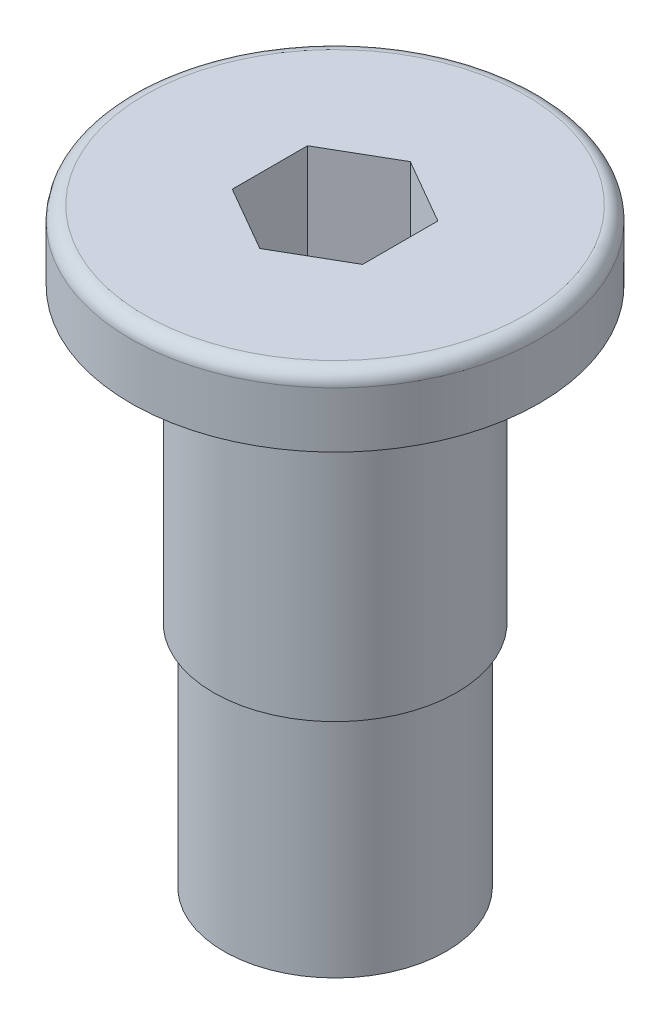
ISO-10303-21;
HEADER;
FILE_DESCRIPTION(('STEP AP214'),'2;1');
FILE_NAME('part.step','',(''),(''),'','','');
FILE_SCHEMA(('AUTOMOTIVE_DESIGN { 1 0 10303 214 1 1 1 1 }'));
ENDSEC;
DATA;
#1=APPLICATION_CONTEXT('core data for automotive mechanical design processes');
#2=APPLICATION_PROTOCOL_DEFINITION('international standard','automotive_design',2000,#1);
#3=PRODUCT_CONTEXT('',#1,'mechanical');
#4=PRODUCT('Part','Part','',(#3));
#5=PRODUCT_RELATED_PRODUCT_CATEGORY('part','',(#4));
#6=PRODUCT_DEFINITION_FORMATION('','',#4);
#7=PRODUCT_DEFINITION_CONTEXT('part definition',#1,'design');
#8=PRODUCT_DEFINITION('design','',#6,#7);
#9=PRODUCT_DEFINITION_SHAPE('','',#8);
#10=(LENGTH_UNIT() NAMED_UNIT(*) SI_UNIT(.MILLI.,.METRE.));
#11=(NAMED_UNIT(*) PLANE_ANGLE_UNIT() SI_UNIT($,.RADIAN.));
#12=(NAMED_UNIT(*) SI_UNIT($,.STERADIAN.) SOLID_ANGLE_UNIT());
#13=UNCERTAINTY_MEASURE_WITH_UNIT(LENGTH_MEASURE(1.E-05),#10,'distance_accuracy_value','');
#14=(GEOMETRIC_REPRESENTATION_CONTEXT(3) GLOBAL_UNCERTAINTY_ASSIGNED_CONTEXT((#13)) GLOBAL_UNIT_ASSIGNED_CONTEXT((#10,
#11,#12)) REPRESENTATION_CONTEXT('',''));
#15=CARTESIAN_POINT('',(0.,0.,0.));
#16=DIRECTION('',(0.,0.,1.));
#17=DIRECTION('',(1.,0.,0.));
#18=AXIS2_PLACEMENT_3D('',#15,#16,#17);
#19=CARTESIAN_POINT('',(0.,-1.27,1.3748153285078));
#20=DIRECTION('',(0.5,0.,0.866025403784439));
#21=DIRECTION('',(0.866025403784439,0.,-0.5));
#22=AXIS2_PLACEMENT_3D('',#19,#20,#21);
#23=PLANE('',#22);
#24=DIRECTION('',(0.,1.,0.));
#25=VECTOR('',#24,1.);
#26=CARTESIAN_POINT('',(1.190625,-1.27,0.687407664253899));
#27=LINE('',#26,#25);
#28=CARTESIAN_POINT('',(1.190625,1.27,0.6874076642539));
#29=VERTEX_POINT('',#28);
#30=CARTESIAN_POINT('',(1.190625,-1.27,0.687407664253899));
#31=VERTEX_POINT('',#30);
#32=EDGE_CURVE('E86',#29,#31,#27,.F.);
#33=ORIENTED_EDGE('',*,*,#32,.T.);
#34=DIRECTION('',(0.866025403784439,0.,-0.5));
#35=VECTOR('',#34,1.);
#36=CARTESIAN_POINT('',(0.,-1.27,1.3748153285078));
#37=LINE('',#36,#35);
#38=CARTESIAN_POINT('',(0.,-1.27,1.3748153285078));
#39=VERTEX_POINT('',#38);
#40=EDGE_CURVE('E75',#39,#31,#37,.T.);
#41=ORIENTED_EDGE('',*,*,#40,.F.);
#42=DIRECTION('',(0.,1.,0.));
#43=VECTOR('',#42,1.);
#44=CARTESIAN_POINT('',(0.,-1.27,1.3748153285078));
#45=LINE('',#44,#43);
#46=CARTESIAN_POINT('',(0.,1.27,1.3748153285078));
#47=VERTEX_POINT('',#46);
#48=EDGE_CURVE('E95',#39,#47,#45,.T.);
#49=ORIENTED_EDGE('',*,*,#48,.T.);
#50=DIRECTION('',(0.866025403784439,0.,-0.5));
#51=VECTOR('',#50,1.);
#52=CARTESIAN_POINT('',(0.,1.27,1.3748153285078));
#53=LINE('',#52,#51);
#54=EDGE_CURVE('E70',#29,#47,#53,.F.);
#55=ORIENTED_EDGE('',*,*,#54,.F.);
#56=EDGE_LOOP('',(#33,#41,#49,#55));
#57=FACE_BOUND('',#56,.T.);
#58=ADVANCED_FACE('F15',(#57),#23,.F.);
#59=CARTESIAN_POINT('',(1.190625,-1.27,0.687407664253899));
#60=DIRECTION('',(1.,0.,0.));
#61=DIRECTION('',(0.,1.,0.));
#62=AXIS2_PLACEMENT_3D('',#59,#60,#61);
#63=PLANE('',#62);
#64=DIRECTION('',(0.,1.,0.));
#65=VECTOR('',#64,1.);
#66=CARTESIAN_POINT('',(1.190625,-1.27,-0.687407664253897));
#67=LINE('',#66,#65);
#68=CARTESIAN_POINT('',(1.190625,1.27,-0.687407664253898));
#69=VERTEX_POINT('',#68);
#70=CARTESIAN_POINT('',(1.190625,-1.27,-0.687407664253898));
#71=VERTEX_POINT('',#70);
#72=EDGE_CURVE('E91',#69,#71,#67,.F.);
#73=ORIENTED_EDGE('',*,*,#72,.T.);
#74=DIRECTION('',(0.,0.,1.));
#75=VECTOR('',#74,1.);
#76=CARTESIAN_POINT('',(1.190625,-1.27,0.687407664253899));
#77=LINE('',#76,#75);
#78=EDGE_CURVE('E79',#31,#71,#77,.F.);
#79=ORIENTED_EDGE('',*,*,#78,.F.);
#80=ORIENTED_EDGE('',*,*,#32,.F.);
#81=DIRECTION('',(0.,0.,1.));
#82=VECTOR('',#81,1.);
#83=CARTESIAN_POINT('',(1.190625,1.27,0.687407664253899));
#84=LINE('',#83,#82);
#85=EDGE_CURVE('E93',#69,#29,#84,.T.);
#86=ORIENTED_EDGE('',*,*,#85,.F.);
#87=EDGE_LOOP('',(#73,#79,#80,#86));
#88=FACE_BOUND('',#87,.T.);
#89=ADVANCED_FACE('F89',(#88),#63,.F.);
#90=CARTESIAN_POINT('',(-1.190625,-1.27,0.687407664253898));
#91=DIRECTION('',(-0.5,0.,0.866025403784439));
#92=DIRECTION('',(0.866025403784439,0.,0.5));
#93=AXIS2_PLACEMENT_3D('',#90,#91,#92);
#94=PLANE('',#93);
#95=ORIENTED_EDGE('',*,*,#48,.F.);
#96=DIRECTION('',(0.866025403784439,0.,0.5));
#97=VECTOR('',#96,1.);
#98=CARTESIAN_POINT('',(-1.190625,-1.27,0.687407664253898));
#99=LINE('',#98,#97);
#100=CARTESIAN_POINT('',(-1.190625,-1.27,0.687407664253898));
#101=VERTEX_POINT('',#100);
#102=EDGE_CURVE('E82',#101,#39,#99,.T.);
#103=ORIENTED_EDGE('',*,*,#102,.F.);
#104=DIRECTION('',(0.,-1.,0.));
#105=VECTOR('',#104,1.);
#106=CARTESIAN_POINT('',(-1.190625,-1.27,0.687407664253898));
#107=LINE('',#106,#105);
#108=CARTESIAN_POINT('',(-1.190625,1.27,0.687407664253898));
#109=VERTEX_POINT('',#108);
#110=EDGE_CURVE('E156',#101,#109,#107,.F.);
#111=ORIENTED_EDGE('',*,*,#110,.T.);
#112=DIRECTION('',(0.866025403784439,0.,0.5));
#113=VECTOR('',#112,1.);
#114=CARTESIAN_POINT('',(-1.190625,1.27,0.687407664253897));
#115=LINE('',#114,#113);
#116=EDGE_CURVE('E168',#47,#109,#115,.F.);
#117=ORIENTED_EDGE('',*,*,#116,.F.);
#118=EDGE_LOOP('',(#95,#103,#111,#117));
#119=FACE_BOUND('',#118,.T.);
#120=ADVANCED_FACE('F171',(#119),#94,.F.);
#121=CARTESIAN_POINT('',(1.190625,-1.27,-0.687407664253898));
#122=DIRECTION('',(0.5,0.,-0.866025403784439));
#123=DIRECTION('',(-0.866025403784439,0.,-0.5));
#124=AXIS2_PLACEMENT_3D('',#121,#122,#123);
#125=PLANE('',#124);
#126=DIRECTION('',(0.,1.,0.));
#127=VECTOR('',#126,1.);
#128=CARTESIAN_POINT('',(0.,-1.27,-1.3748153285078));
#129=LINE('',#128,#127);
#130=CARTESIAN_POINT('',(0.,1.27,-1.3748153285078));
#131=VERTEX_POINT('',#130);
#132=CARTESIAN_POINT('',(0.,-1.27,-1.3748153285078));
#133=VERTEX_POINT('',#132);
#134=EDGE_CURVE('E151',#131,#133,#129,.F.);
#135=ORIENTED_EDGE('',*,*,#134,.T.);
#136=DIRECTION('',(-0.866025403784439,0.,-0.5));
#137=VECTOR('',#136,1.);
#138=CARTESIAN_POINT('',(1.190625,-1.27,-0.687407664253898));
#139=LINE('',#138,#137);
#140=EDGE_CURVE('E162',#71,#133,#139,.T.);
#141=ORIENTED_EDGE('',*,*,#140,.F.);
#142=ORIENTED_EDGE('',*,*,#72,.F.);
#143=DIRECTION('',(-0.866025403784439,0.,-0.5));
#144=VECTOR('',#143,1.);
#145=CARTESIAN_POINT('',(1.190625,1.27,-0.6874076642539));
#146=LINE('',#145,#144);
#147=EDGE_CURVE('E164',#131,#69,#146,.F.);
#148=ORIENTED_EDGE('',*,*,#147,.F.);
#149=EDGE_LOOP('',(#135,#141,#142,#148));
#150=FACE_BOUND('',#149,.T.);
#151=ADVANCED_FACE('F181',(#150),#125,.F.);
#152=CARTESIAN_POINT('',(0.,-1.27,-1.3748153285078));
#153=DIRECTION('',(0.,1.,0.));
#154=DIRECTION('',(-1.,0.,0.));
#155=AXIS2_PLACEMENT_3D('',#152,#153,#154);
#156=PLANE('',#155);
#157=ORIENTED_EDGE('',*,*,#40,.T.);
#158=ORIENTED_EDGE('',*,*,#78,.T.);
#159=ORIENTED_EDGE('',*,*,#140,.T.);
#160=DIRECTION('',(-0.866025403784439,0.,0.5));
#161=VECTOR('',#160,1.);
#162=CARTESIAN_POINT('',(0.,-1.27,-1.3748153285078));
#163=LINE('',#162,#161);
#164=CARTESIAN_POINT('',(-1.190625,-1.27,-0.687407664253899));
#165=VERTEX_POINT('',#164);
#166=EDGE_CURVE('E149',#133,#165,#163,.T.);
#167=ORIENTED_EDGE('',*,*,#166,.T.);
#168=DIRECTION('',(0.,0.,1.));
#169=VECTOR('',#168,1.);
#170=CARTESIAN_POINT('',(-1.190625,-1.27,-0.687407664253899));
#171=LINE('',#170,#169);
#172=EDGE_CURVE('E159',#165,#101,#171,.T.);
#173=ORIENTED_EDGE('',*,*,#172,.T.);
#174=ORIENTED_EDGE('',*,*,#102,.T.);
#175=EDGE_LOOP('',(#157,#158,#159,#167,#173,#174));
#176=FACE_BOUND('',#175,.T.);
#177=ADVANCED_FACE('F76',(#176),#156,.T.);
#178=CARTESIAN_POINT('',(-1.190625,-1.27,-0.687407664253899));
#179=DIRECTION('',(-1.,0.,0.));
#180=DIRECTION('',(0.,-1.,0.));
#181=AXIS2_PLACEMENT_3D('',#178,#179,#180);
#182=PLANE('',#181);
#183=ORIENTED_EDGE('',*,*,#110,.F.);
#184=ORIENTED_EDGE('',*,*,#172,.F.);
#185=DIRECTION('',(0.,1.,0.));
#186=VECTOR('',#185,1.);
#187=CARTESIAN_POINT('',(-1.190625,-1.27,-0.687407664253899));
#188=LINE('',#187,#186);
#189=CARTESIAN_POINT('',(-1.190625,1.27,-0.687407664253898));
#190=VERTEX_POINT('',#189);
#191=EDGE_CURVE('E140',#165,#190,#188,.T.);
#192=ORIENTED_EDGE('',*,*,#191,.T.);
#193=DIRECTION('',(0.,0.,1.));
#194=VECTOR('',#193,1.);
#195=CARTESIAN_POINT('',(-1.190625,1.27,-0.687407664253899));
#196=LINE('',#195,#194);
#197=EDGE_CURVE('E153',#109,#190,#196,.F.);
#198=ORIENTED_EDGE('',*,*,#197,.F.);
#199=EDGE_LOOP('',(#183,#184,#192,#198));
#200=FACE_BOUND('',#199,.T.);
#201=ADVANCED_FACE('F188',(#200),#182,.F.);
#202=CARTESIAN_POINT('',(0.,-1.27,-1.3748153285078));
#203=DIRECTION('',(-0.5,0.,-0.866025403784439));
#204=DIRECTION('',(-0.866025403784439,0.,0.5));
#205=AXIS2_PLACEMENT_3D('',#202,#203,#204);
#206=PLANE('',#205);
#207=ORIENTED_EDGE('',*,*,#191,.F.);
#208=ORIENTED_EDGE('',*,*,#166,.F.);
#209=ORIENTED_EDGE('',*,*,#134,.F.);
#210=DIRECTION('',(0.866025403784439,0.,-0.5));
#211=VECTOR('',#210,1.);
#212=CARTESIAN_POINT('',(-1.190625,1.27,-0.687407664253899));
#213=LINE('',#212,#211);
#214=EDGE_CURVE('E148',#190,#131,#213,.T.);
#215=ORIENTED_EDGE('',*,*,#214,.F.);
#216=EDGE_LOOP('',(#207,#208,#209,#215));
#217=FACE_BOUND('',#216,.T.);
#218=ADVANCED_FACE('F186',(#217),#206,.F.);
#219=CARTESIAN_POINT('',(0.,1.27,0.));
#220=DIRECTION('',(0.,1.,0.));
#221=DIRECTION('',(-1.,0.,0.));
#222=AXIS2_PLACEMENT_3D('',#219,#220,#221);
#223=PLANE('',#222);
#224=ORIENTED_EDGE('',*,*,#197,.T.);
#225=ORIENTED_EDGE('',*,*,#214,.T.);
#226=ORIENTED_EDGE('',*,*,#147,.T.);
#227=ORIENTED_EDGE('',*,*,#85,.T.);
#228=ORIENTED_EDGE('',*,*,#54,.T.);
#229=ORIENTED_EDGE('',*,*,#116,.T.);
#230=EDGE_LOOP('',(#224,#225,#226,#227,#228,#229));
#231=FACE_BOUND('',#230,.T.);
#232=CARTESIAN_POINT('',(0.,1.27,0.));
#233=DIRECTION('',(0.,-1.,0.));
#234=DIRECTION('',(1.,0.,0.));
#235=AXIS2_PLACEMENT_3D('',#232,#233,#234);
#236=CIRCLE('',#235,3.4798);
#237=CARTESIAN_POINT('',(3.47980000000001,1.27,0.));
#238=VERTEX_POINT('',#237);
#239=CARTESIAN_POINT('',(-3.47979999999999,1.27000000000001,0.));
#240=VERTEX_POINT('',#239);
#241=EDGE_CURVE('E34',#238,#240,#236,.T.);
#242=ORIENTED_EDGE('',*,*,#241,.F.);
#243=CARTESIAN_POINT('',(0.,1.27,0.));
#244=DIRECTION('',(0.,-1.,0.));
#245=DIRECTION('',(-1.,0.,0.));
#246=AXIS2_PLACEMENT_3D('',#243,#244,#245);
#247=CIRCLE('',#246,3.4798);
#248=EDGE_CURVE('E114',#240,#238,#247,.T.);
#249=ORIENTED_EDGE('',*,*,#248,.F.);
#250=EDGE_LOOP('',(#242,#249));
#251=FACE_BOUND('',#250,.T.);
#252=ADVANCED_FACE('F128',(#231,#251),#223,.T.);
#253=CARTESIAN_POINT('',(0.,1.016,0.));
#254=DIRECTION('',(0.,1.,0.));
#255=DIRECTION('',(-1.,0.,0.));
#256=AXIS2_PLACEMENT_3D('',#253,#254,#255);
#257=TOROIDAL_SURFACE('',#256,3.4798,0.254);
#258=CARTESIAN_POINT('',(0.,1.016,0.));
#259=DIRECTION('',(0.,-1.,0.));
#260=DIRECTION('',(1.,0.,0.));
#261=AXIS2_PLACEMENT_3D('',#258,#259,#260);
#262=CIRCLE('',#261,3.7338);
#263=CARTESIAN_POINT('',(3.73380000000001,1.016,0.));
#264=VERTEX_POINT('',#263);
#265=EDGE_CURVE('E110',#264,#264,#262,.T.);
#266=ORIENTED_EDGE('',*,*,#265,.F.);
#267=EDGE_LOOP('',(#266));
#268=FACE_BOUND('',#267,.T.);
#269=ORIENTED_EDGE('',*,*,#248,.T.);
#270=ORIENTED_EDGE('',*,*,#241,.T.);
#271=EDGE_LOOP('',(#269,#270));
#272=FACE_BOUND('',#271,.T.);
#273=ADVANCED_FACE('F122',(#268,#272),#257,.T.);
#274=CARTESIAN_POINT('',(2.032,-9.525,0.));
#275=DIRECTION('',(0.,-1.,0.));
#276=DIRECTION('',(1.,0.,0.));
#277=AXIS2_PLACEMENT_3D('',#274,#275,#276);
#278=PLANE('',#277);
#279=CARTESIAN_POINT('',(0.,-9.525,0.));
#280=DIRECTION('',(0.,-1.,0.));
#281=DIRECTION('',(1.,0.,0.));
#282=AXIS2_PLACEMENT_3D('',#279,#280,#281);
#283=CIRCLE('',#282,2.032);
#284=CARTESIAN_POINT('',(2.032,-9.525,0.));
#285=VERTEX_POINT('',#284);
#286=EDGE_CURVE('E108',#285,#285,#283,.F.);
#287=ORIENTED_EDGE('',*,*,#286,.F.);
#288=EDGE_LOOP('',(#287));
#289=FACE_BOUND('',#288,.T.);
#290=ADVANCED_FACE('F127',(#289),#278,.T.);
#291=CARTESIAN_POINT('',(0.,-9.525,0.));
#292=DIRECTION('',(0.,-1.,0.));
#293=DIRECTION('',(1.,0.,0.));
#294=AXIS2_PLACEMENT_3D('',#291,#292,#293);
#295=CYLINDRICAL_SURFACE('',#294,3.7338);
#296=ORIENTED_EDGE('',*,*,#265,.T.);
#297=EDGE_LOOP('',(#296));
#298=FACE_BOUND('',#297,.T.);
#299=CARTESIAN_POINT('',(0.,0.,0.));
#300=DIRECTION('',(0.,-1.,0.));
#301=DIRECTION('',(1.,0.,0.));
#302=AXIS2_PLACEMENT_3D('',#299,#300,#301);
#303=CIRCLE('',#302,3.7338);
#304=CARTESIAN_POINT('',(3.73380000000001,0.,0.));
#305=VERTEX_POINT('',#304);
#306=EDGE_CURVE('E105',#305,#305,#303,.T.);
#307=ORIENTED_EDGE('',*,*,#306,.F.);
#308=EDGE_LOOP('',(#307));
#309=FACE_BOUND('',#308,.T.);
#310=ADVANCED_FACE('F215',(#298,#309),#295,.T.);
#311=CARTESIAN_POINT('',(0.,-9.525,0.));
#312=DIRECTION('',(0.,-1.,0.));
#313=DIRECTION('',(1.,0.,0.));
#314=AXIS2_PLACEMENT_3D('',#311,#312,#313);
#315=CYLINDRICAL_SURFACE('',#314,2.032);
#316=CARTESIAN_POINT('',(0.,-5.334,0.));
#317=DIRECTION('',(0.,-1.,0.));
#318=DIRECTION('',(1.,0.,0.));
#319=AXIS2_PLACEMENT_3D('',#316,#317,#318);
#320=CIRCLE('',#319,2.032);
#321=CARTESIAN_POINT('',(2.032,-5.334,0.));
#322=VERTEX_POINT('',#321);
#323=EDGE_CURVE('E102',#322,#322,#320,.F.);
#324=ORIENTED_EDGE('',*,*,#323,.F.);
#325=EDGE_LOOP('',(#324));
#326=FACE_BOUND('',#325,.T.);
#327=ORIENTED_EDGE('',*,*,#286,.T.);
#328=EDGE_LOOP('',(#327));
#329=FACE_BOUND('',#328,.T.);
#330=ADVANCED_FACE('F212',(#326,#329),#315,.T.);
#331=CARTESIAN_POINT('',(3.73380000000001,0.,0.));
#332=DIRECTION('',(0.,-1.,0.));
#333=DIRECTION('',(1.,0.,0.));
#334=AXIS2_PLACEMENT_3D('',#331,#332,#333);
#335=PLANE('',#334);
#336=CARTESIAN_POINT('',(0.,0.,0.));
#337=DIRECTION('',(0.,-1.,0.));
#338=DIRECTION('',(1.,0.,0.));
#339=AXIS2_PLACEMENT_3D('',#336,#337,#338);
#340=CIRCLE('',#339,2.22249999999999);
#341=CARTESIAN_POINT('',(2.2225,0.,0.));
#342=VERTEX_POINT('',#341);
#343=EDGE_CURVE('E26',#342,#342,#340,.T.);
#344=ORIENTED_EDGE('',*,*,#343,.F.);
#345=EDGE_LOOP('',(#344));
#346=FACE_BOUND('',#345,.T.);
#347=ORIENTED_EDGE('',*,*,#306,.T.);
#348=EDGE_LOOP('',(#347));
#349=FACE_BOUND('',#348,.T.);
#350=ADVANCED_FACE('F205',(#346,#349),#335,.T.);
#351=CARTESIAN_POINT('',(2.2225,-5.334,0.));
#352=DIRECTION('',(0.,-1.,0.));
#353=DIRECTION('',(1.,0.,0.));
#354=AXIS2_PLACEMENT_3D('',#351,#352,#353);
#355=PLANE('',#354);
#356=ORIENTED_EDGE('',*,*,#323,.T.);
#357=EDGE_LOOP('',(#356));
#358=FACE_BOUND('',#357,.T.);
#359=CARTESIAN_POINT('',(0.,-5.334,0.));
#360=DIRECTION('',(0.,-1.,0.));
#361=DIRECTION('',(1.,0.,0.));
#362=AXIS2_PLACEMENT_3D('',#359,#360,#361);
#363=CIRCLE('',#362,2.22249999999999);
#364=CARTESIAN_POINT('',(2.2225,-5.334,0.));
#365=VERTEX_POINT('',#364);
#366=EDGE_CURVE('E9',#365,#365,#363,.F.);
#367=ORIENTED_EDGE('',*,*,#366,.F.);
#368=EDGE_LOOP('',(#367));
#369=FACE_BOUND('',#368,.T.);
#370=ADVANCED_FACE('F199',(#358,#369),#355,.T.);
#371=CARTESIAN_POINT('',(0.,-9.525,0.));
#372=DIRECTION('',(0.,-1.,0.));
#373=DIRECTION('',(1.,0.,0.));
#374=AXIS2_PLACEMENT_3D('',#371,#372,#373);
#375=CYLINDRICAL_SURFACE('',#374,2.22249999999999);
#376=ORIENTED_EDGE('',*,*,#366,.T.);
#377=EDGE_LOOP('',(#376));
#378=FACE_BOUND('',#377,.T.);
#379=ORIENTED_EDGE('',*,*,#343,.T.);
#380=EDGE_LOOP('',(#379));
#381=FACE_BOUND('',#380,.T.);
#382=ADVANCED_FACE('F197',(#378,#381),#375,.T.);
#383=CLOSED_SHELL('',(#58,#89,#120,#151,#177,#201,#218,#252,#273,#290,#310,#330,#350,#370,#382));
#384=MANIFOLD_SOLID_BREP('B1',#383);
#385=ADVANCED_BREP_SHAPE_REPRESENTATION('',(#18,#384),#14);
#386=SHAPE_DEFINITION_REPRESENTATION(#9,#385);
ENDSEC;
END-ISO-10303-21;
